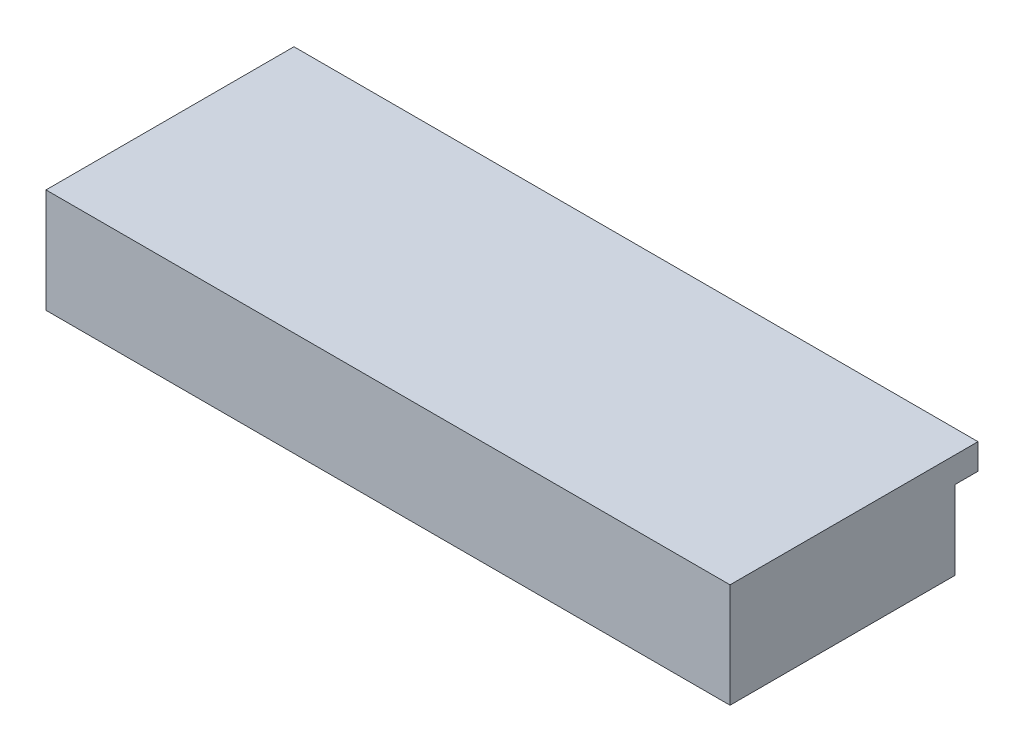
ISO-10303-21;
HEADER;
FILE_DESCRIPTION(('STEP AP214'),'2;1');
FILE_NAME('part.step','',(''),(''),'','','');
FILE_SCHEMA(('AUTOMOTIVE_DESIGN { 1 0 10303 214 1 1 1 1 }'));
ENDSEC;
DATA;
#1=APPLICATION_CONTEXT('core data for automotive mechanical design processes');
#2=APPLICATION_PROTOCOL_DEFINITION('international standard','automotive_design',2000,#1);
#3=PRODUCT_CONTEXT('',#1,'mechanical');
#4=PRODUCT('Part','Part','',(#3));
#5=PRODUCT_RELATED_PRODUCT_CATEGORY('part','',(#4));
#6=PRODUCT_DEFINITION_FORMATION('','',#4);
#7=PRODUCT_DEFINITION_CONTEXT('part definition',#1,'design');
#8=PRODUCT_DEFINITION('design','',#6,#7);
#9=PRODUCT_DEFINITION_SHAPE('','',#8);
#10=(LENGTH_UNIT() NAMED_UNIT(*) SI_UNIT(.MILLI.,.METRE.));
#11=(NAMED_UNIT(*) PLANE_ANGLE_UNIT() SI_UNIT($,.RADIAN.));
#12=(NAMED_UNIT(*) SI_UNIT($,.STERADIAN.) SOLID_ANGLE_UNIT());
#13=UNCERTAINTY_MEASURE_WITH_UNIT(LENGTH_MEASURE(1.E-05),#10,'distance_accuracy_value','');
#14=(GEOMETRIC_REPRESENTATION_CONTEXT(3) GLOBAL_UNCERTAINTY_ASSIGNED_CONTEXT((#13)) GLOBAL_UNIT_ASSIGNED_CONTEXT((#10,
#11,#12)) REPRESENTATION_CONTEXT('',''));
#15=CARTESIAN_POINT('',(0.,0.,0.));
#16=DIRECTION('',(0.,0.,1.));
#17=DIRECTION('',(1.,0.,0.));
#18=AXIS2_PLACEMENT_3D('',#15,#16,#17);
#19=CARTESIAN_POINT('',(83.,6.50000000000004,-1.5));
#20=DIRECTION('',(0.,0.,-1.));
#21=DIRECTION('',(-1.,0.,0.));
#22=AXIS2_PLACEMENT_3D('',#19,#20,#21);
#23=PLANE('',#22);
#24=DIRECTION('',(0.,1.,0.));
#25=VECTOR('',#24,1.);
#26=CARTESIAN_POINT('',(238.,-21.0000000000001,-1.5));
#27=LINE('',#26,#25);
#28=CARTESIAN_POINT('',(238.,-21.0000000000001,-1.5));
#29=VERTEX_POINT('',#28);
#30=CARTESIAN_POINT('',(238.,24.9999999999999,-1.5));
#31=VERTEX_POINT('',#30);
#32=EDGE_CURVE('E11',#29,#31,#27,.T.);
#33=ORIENTED_EDGE('',*,*,#32,.F.);
#34=DIRECTION('',(1.,0.,0.));
#35=VECTOR('',#34,1.);
#36=CARTESIAN_POINT('',(238.,-21.0000000000001,-1.5));
#37=LINE('',#36,#35);
#38=CARTESIAN_POINT('',(70.5,-21.,-1.5));
#39=VERTEX_POINT('',#38);
#40=EDGE_CURVE('E213',#39,#29,#37,.T.);
#41=ORIENTED_EDGE('',*,*,#40,.F.);
#42=DIRECTION('',(0.,-1.,0.));
#43=VECTOR('',#42,1.);
#44=CARTESIAN_POINT('',(70.5,-21.,-1.5));
#45=LINE('',#44,#43);
#46=CARTESIAN_POINT('',(70.5,-8.00000000000005,-1.5));
#47=VERTEX_POINT('',#46);
#48=EDGE_CURVE('E211',#47,#39,#45,.T.);
#49=ORIENTED_EDGE('',*,*,#48,.F.);
#50=CARTESIAN_POINT('',(72.5,-8.00000000000005,-1.5));
#51=DIRECTION('',(0.,0.,-1.));
#52=DIRECTION('',(-1.,0.,0.));
#53=AXIS2_PLACEMENT_3D('',#50,#51,#52);
#54=CIRCLE('',#53,2.);
#55=CARTESIAN_POINT('',(72.5,-6.00000000000005,-1.5));
#56=VERTEX_POINT('',#55);
#57=EDGE_CURVE('E253',#56,#47,#54,.F.);
#58=ORIENTED_EDGE('',*,*,#57,.F.);
#59=DIRECTION('',(-1.,0.,0.));
#60=VECTOR('',#59,1.);
#61=CARTESIAN_POINT('',(72.5,-6.00000000000005,-1.5));
#62=LINE('',#61,#60);
#63=CARTESIAN_POINT('',(83.,-5.99999999999994,-1.5));
#64=VERTEX_POINT('',#63);
#65=EDGE_CURVE('E256',#64,#56,#62,.T.);
#66=ORIENTED_EDGE('',*,*,#65,.F.);
#67=CARTESIAN_POINT('',(83.,6.50000000000004,-1.5));
#68=DIRECTION('',(0.,0.,-1.));
#69=DIRECTION('',(-1.,0.,0.));
#70=AXIS2_PLACEMENT_3D('',#67,#68,#69);
#71=CIRCLE('',#70,12.5);
#72=CARTESIAN_POINT('',(83.,19.,-1.5));
#73=VERTEX_POINT('',#72);
#74=EDGE_CURVE('E260',#73,#64,#71,.T.);
#75=ORIENTED_EDGE('',*,*,#74,.F.);
#76=DIRECTION('',(1.,0.,0.));
#77=VECTOR('',#76,1.);
#78=CARTESIAN_POINT('',(83.,19.,-1.5));
#79=LINE('',#78,#77);
#80=CARTESIAN_POINT('',(-70.25,19.0000000000001,-1.5));
#81=VERTEX_POINT('',#80);
#82=EDGE_CURVE('E264',#81,#73,#79,.T.);
#83=ORIENTED_EDGE('',*,*,#82,.F.);
#84=CARTESIAN_POINT('',(-70.25,6.50000000000006,-1.5));
#85=DIRECTION('',(0.,0.,-1.));
#86=DIRECTION('',(-1.,0.,0.));
#87=AXIS2_PLACEMENT_3D('',#84,#85,#86);
#88=CIRCLE('',#87,12.5);
#89=CARTESIAN_POINT('',(-70.25,-5.99999999999994,-1.5));
#90=VERTEX_POINT('',#89);
#91=EDGE_CURVE('E268',#90,#81,#88,.T.);
#92=ORIENTED_EDGE('',*,*,#91,.F.);
#93=DIRECTION('',(-1.,0.,0.));
#94=VECTOR('',#93,1.);
#95=CARTESIAN_POINT('',(-70.25,-5.99999999999994,-1.5));
#96=LINE('',#95,#94);
#97=CARTESIAN_POINT('',(-61.5,-5.99999999999995,-1.5));
#98=VERTEX_POINT('',#97);
#99=EDGE_CURVE('E272',#98,#90,#96,.T.);
#100=ORIENTED_EDGE('',*,*,#99,.F.);
#101=CARTESIAN_POINT('',(-61.5,-7.99999999999995,-1.5));
#102=DIRECTION('',(0.,0.,-1.));
#103=DIRECTION('',(-1.,0.,0.));
#104=AXIS2_PLACEMENT_3D('',#101,#102,#103);
#105=CIRCLE('',#104,2.);
#106=CARTESIAN_POINT('',(-59.5,-7.99999999999995,-1.5));
#107=VERTEX_POINT('',#106);
#108=EDGE_CURVE('E276',#107,#98,#105,.F.);
#109=ORIENTED_EDGE('',*,*,#108,.F.);
#110=DIRECTION('',(0.,1.,0.));
#111=VECTOR('',#110,1.);
#112=CARTESIAN_POINT('',(-59.5,-7.99999999999995,-1.5));
#113=LINE('',#112,#111);
#114=CARTESIAN_POINT('',(-59.5,-21.,-1.5));
#115=VERTEX_POINT('',#114);
#116=EDGE_CURVE('E228',#115,#107,#113,.T.);
#117=ORIENTED_EDGE('',*,*,#116,.F.);
#118=DIRECTION('',(1.,0.,0.));
#119=VECTOR('',#118,1.);
#120=CARTESIAN_POINT('',(-59.5,-21.,-1.5));
#121=LINE('',#120,#119);
#122=CARTESIAN_POINT('',(-162.,-20.9999999999999,-1.5));
#123=VERTEX_POINT('',#122);
#124=EDGE_CURVE('E114',#123,#115,#121,.T.);
#125=ORIENTED_EDGE('',*,*,#124,.F.);
#126=DIRECTION('',(0.,-1.,0.));
#127=VECTOR('',#126,1.);
#128=CARTESIAN_POINT('',(-162.,25.0000000000001,-1.5));
#129=LINE('',#128,#127);
#130=CARTESIAN_POINT('',(-162.,24.9999999999998,-1.5));
#131=VERTEX_POINT('',#130);
#132=EDGE_CURVE('E122',#131,#123,#129,.T.);
#133=ORIENTED_EDGE('',*,*,#132,.F.);
#134=DIRECTION('',(-1.,0.,0.));
#135=VECTOR('',#134,1.);
#136=CARTESIAN_POINT('',(238.,24.9999999999999,-1.5));
#137=LINE('',#136,#135);
#138=EDGE_CURVE('E118',#31,#131,#137,.T.);
#139=ORIENTED_EDGE('',*,*,#138,.F.);
#140=EDGE_LOOP('',(#33,#41,#49,#58,#66,#75,#83,#92,#100,#109,#117,#125,#133,#139));
#141=FACE_BOUND('',#140,.T.);
#142=ADVANCED_FACE('F31',(#141),#23,.T.);
#143=CARTESIAN_POINT('',(-162.,25.0000000000001,-404.136312321678));
#144=DIRECTION('',(-1.,0.,0.));
#145=DIRECTION('',(0.,-1.,0.));
#146=AXIS2_PLACEMENT_3D('',#143,#144,#145);
#147=PLANE('',#146);
#148=DIRECTION('',(0.,-1.,0.));
#149=VECTOR('',#148,1.);
#150=CARTESIAN_POINT('',(-162.,25.0000000000001,130.));
#151=LINE('',#150,#149);
#152=CARTESIAN_POINT('',(-162.,39.9999999999998,130.));
#153=VERTEX_POINT('',#152);
#154=CARTESIAN_POINT('',(-162.,-20.9999999999999,130.));
#155=VERTEX_POINT('',#154);
#156=EDGE_CURVE('E186',#153,#155,#151,.T.);
#157=ORIENTED_EDGE('',*,*,#156,.F.);
#158=DIRECTION('',(0.,0.,1.));
#159=VECTOR('',#158,1.);
#160=CARTESIAN_POINT('',(-162.,39.9999999999998,-15.));
#161=LINE('',#160,#159);
#162=CARTESIAN_POINT('',(-162.,39.9999999999998,-15.));
#163=VERTEX_POINT('',#162);
#164=EDGE_CURVE('E149',#163,#153,#161,.T.);
#165=ORIENTED_EDGE('',*,*,#164,.F.);
#166=DIRECTION('',(0.,-1.,0.));
#167=VECTOR('',#166,1.);
#168=CARTESIAN_POINT('',(-162.,24.9999999999998,-15.));
#169=LINE('',#168,#167);
#170=CARTESIAN_POINT('',(-162.,24.9999999999998,-15.));
#171=VERTEX_POINT('',#170);
#172=EDGE_CURVE('E168',#163,#171,#169,.T.);
#173=ORIENTED_EDGE('',*,*,#172,.T.);
#174=DIRECTION('',(0.,0.,1.));
#175=VECTOR('',#174,1.);
#176=CARTESIAN_POINT('',(-162.,24.9999999999998,-15.));
#177=LINE('',#176,#175);
#178=EDGE_CURVE('E144',#171,#131,#177,.T.);
#179=ORIENTED_EDGE('',*,*,#178,.T.);
#180=ORIENTED_EDGE('',*,*,#132,.T.);
#181=DIRECTION('',(0.,0.,1.));
#182=VECTOR('',#181,1.);
#183=CARTESIAN_POINT('',(-162.,-20.9999999999999,-404.136312321678));
#184=LINE('',#183,#182);
#185=EDGE_CURVE('E202',#123,#155,#184,.T.);
#186=ORIENTED_EDGE('',*,*,#185,.T.);
#187=EDGE_LOOP('',(#157,#165,#173,#179,#180,#186));
#188=FACE_BOUND('',#187,.T.);
#189=ADVANCED_FACE('F338',(#188),#147,.T.);
#190=CARTESIAN_POINT('',(-59.5,-21.,-404.136312321678));
#191=DIRECTION('',(0.,-1.,0.));
#192=DIRECTION('',(1.,0.,0.));
#193=AXIS2_PLACEMENT_3D('',#190,#191,#192);
#194=PLANE('',#193);
#195=ORIENTED_EDGE('',*,*,#185,.F.);
#196=ORIENTED_EDGE('',*,*,#124,.T.);
#197=DIRECTION('',(0.,0.,1.));
#198=VECTOR('',#197,1.);
#199=CARTESIAN_POINT('',(-59.5,-21.,-404.136312321678));
#200=LINE('',#199,#198);
#201=CARTESIAN_POINT('',(-59.5,-21.,0.));
#202=VERTEX_POINT('',#201);
#203=EDGE_CURVE('E224',#115,#202,#200,.T.);
#204=ORIENTED_EDGE('',*,*,#203,.T.);
#205=DIRECTION('',(1.,0.,0.));
#206=VECTOR('',#205,1.);
#207=CARTESIAN_POINT('',(-162.,-20.9999999999999,0.));
#208=LINE('',#207,#206);
#209=CARTESIAN_POINT('',(70.5,-21.,0.));
#210=VERTEX_POINT('',#209);
#211=EDGE_CURVE('E143',#202,#210,#208,.T.);
#212=ORIENTED_EDGE('',*,*,#211,.T.);
#213=DIRECTION('',(0.,0.,1.));
#214=VECTOR('',#213,1.);
#215=CARTESIAN_POINT('',(70.5,-21.,-404.136312321678));
#216=LINE('',#215,#214);
#217=EDGE_CURVE('E207',#39,#210,#216,.T.);
#218=ORIENTED_EDGE('',*,*,#217,.F.);
#219=ORIENTED_EDGE('',*,*,#40,.T.);
#220=DIRECTION('',(0.,0.,1.));
#221=VECTOR('',#220,1.);
#222=CARTESIAN_POINT('',(238.,-21.0000000000001,-404.136312321678));
#223=LINE('',#222,#221);
#224=CARTESIAN_POINT('',(238.,-21.0000000000001,130.));
#225=VERTEX_POINT('',#224);
#226=EDGE_CURVE('E40',#29,#225,#223,.T.);
#227=ORIENTED_EDGE('',*,*,#226,.T.);
#228=DIRECTION('',(1.,0.,0.));
#229=VECTOR('',#228,1.);
#230=CARTESIAN_POINT('',(-162.,-20.9999999999999,130.));
#231=LINE('',#230,#229);
#232=EDGE_CURVE('E147',#155,#225,#231,.T.);
#233=ORIENTED_EDGE('',*,*,#232,.F.);
#234=EDGE_LOOP('',(#195,#196,#204,#212,#218,#219,#227,#233));
#235=FACE_BOUND('',#234,.T.);
#236=ADVANCED_FACE('F222',(#235),#194,.T.);
#237=CARTESIAN_POINT('',(-59.5,-7.99999999999995,-404.136312321678));
#238=DIRECTION('',(1.,0.,0.));
#239=DIRECTION('',(0.,1.,0.));
#240=AXIS2_PLACEMENT_3D('',#237,#238,#239);
#241=PLANE('',#240);
#242=ORIENTED_EDGE('',*,*,#203,.F.);
#243=ORIENTED_EDGE('',*,*,#116,.T.);
#244=DIRECTION('',(0.,0.,1.));
#245=VECTOR('',#244,1.);
#246=CARTESIAN_POINT('',(-59.5,-7.99999999999995,-404.136312321678));
#247=LINE('',#246,#245);
#248=CARTESIAN_POINT('',(-59.5,-7.99999999999995,0.));
#249=VERTEX_POINT('',#248);
#250=EDGE_CURVE('E233',#107,#249,#247,.T.);
#251=ORIENTED_EDGE('',*,*,#250,.T.);
#252=DIRECTION('',(0.,1.,0.));
#253=VECTOR('',#252,1.);
#254=CARTESIAN_POINT('',(-59.5,-7.99999999999995,0.));
#255=LINE('',#254,#253);
#256=EDGE_CURVE('E230',#202,#249,#255,.T.);
#257=ORIENTED_EDGE('',*,*,#256,.F.);
#258=EDGE_LOOP('',(#242,#243,#251,#257));
#259=FACE_BOUND('',#258,.T.);
#260=ADVANCED_FACE('F231',(#259),#241,.T.);
#261=CARTESIAN_POINT('',(-61.5,-7.99999999999995,-404.136312321678));
#262=DIRECTION('',(0.,0.,1.));
#263=DIRECTION('',(1.,0.,0.));
#264=AXIS2_PLACEMENT_3D('',#261,#262,#263);
#265=CYLINDRICAL_SURFACE('',#264,2.);
#266=ORIENTED_EDGE('',*,*,#250,.F.);
#267=ORIENTED_EDGE('',*,*,#108,.T.);
#268=DIRECTION('',(0.,0.,1.));
#269=VECTOR('',#268,1.);
#270=CARTESIAN_POINT('',(-61.5,-5.99999999999995,-404.136312321678));
#271=LINE('',#270,#269);
#272=CARTESIAN_POINT('',(-61.5,-5.99999999999995,0.));
#273=VERTEX_POINT('',#272);
#274=EDGE_CURVE('E275',#98,#273,#271,.T.);
#275=ORIENTED_EDGE('',*,*,#274,.T.);
#276=CARTESIAN_POINT('',(-61.5,-7.99999999999995,0.));
#277=DIRECTION('',(0.,0.,1.));
#278=DIRECTION('',(1.,0.,0.));
#279=AXIS2_PLACEMENT_3D('',#276,#277,#278);
#280=CIRCLE('',#279,2.);
#281=EDGE_CURVE('E236',#249,#273,#280,.T.);
#282=ORIENTED_EDGE('',*,*,#281,.F.);
#283=EDGE_LOOP('',(#266,#267,#275,#282));
#284=FACE_BOUND('',#283,.T.);
#285=ADVANCED_FACE('F349',(#284),#265,.T.);
#286=CARTESIAN_POINT('',(-70.25,-5.99999999999994,-404.136312321678));
#287=DIRECTION('',(0.,1.,0.));
#288=DIRECTION('',(-1.,0.,0.));
#289=AXIS2_PLACEMENT_3D('',#286,#287,#288);
#290=PLANE('',#289);
#291=ORIENTED_EDGE('',*,*,#274,.F.);
#292=ORIENTED_EDGE('',*,*,#99,.T.);
#293=DIRECTION('',(0.,0.,1.));
#294=VECTOR('',#293,1.);
#295=CARTESIAN_POINT('',(-70.25,-5.99999999999994,-404.136312321678));
#296=LINE('',#295,#294);
#297=CARTESIAN_POINT('',(-70.25,-5.99999999999994,0.));
#298=VERTEX_POINT('',#297);
#299=EDGE_CURVE('E271',#90,#298,#296,.T.);
#300=ORIENTED_EDGE('',*,*,#299,.T.);
#301=DIRECTION('',(-1.,0.,0.));
#302=VECTOR('',#301,1.);
#303=CARTESIAN_POINT('',(-70.25,-5.99999999999994,0.));
#304=LINE('',#303,#302);
#305=EDGE_CURVE('E238',#273,#298,#304,.T.);
#306=ORIENTED_EDGE('',*,*,#305,.F.);
#307=EDGE_LOOP('',(#291,#292,#300,#306));
#308=FACE_BOUND('',#307,.T.);
#309=ADVANCED_FACE('F311',(#308),#290,.T.);
#310=CARTESIAN_POINT('',(-70.25,6.50000000000006,-404.136312321678));
#311=DIRECTION('',(0.,0.,1.));
#312=DIRECTION('',(1.,0.,0.));
#313=AXIS2_PLACEMENT_3D('',#310,#311,#312);
#314=CYLINDRICAL_SURFACE('',#313,12.5);
#315=ORIENTED_EDGE('',*,*,#299,.F.);
#316=ORIENTED_EDGE('',*,*,#91,.T.);
#317=DIRECTION('',(0.,0.,1.));
#318=VECTOR('',#317,1.);
#319=CARTESIAN_POINT('',(-70.25,19.0000000000001,-404.136312321678));
#320=LINE('',#319,#318);
#321=CARTESIAN_POINT('',(-70.25,19.0000000000001,0.));
#322=VERTEX_POINT('',#321);
#323=EDGE_CURVE('E267',#81,#322,#320,.T.);
#324=ORIENTED_EDGE('',*,*,#323,.T.);
#325=CARTESIAN_POINT('',(-70.25,6.50000000000006,0.));
#326=DIRECTION('',(0.,0.,-1.));
#327=DIRECTION('',(1.,0.,0.));
#328=AXIS2_PLACEMENT_3D('',#325,#326,#327);
#329=CIRCLE('',#328,12.5);
#330=EDGE_CURVE('E304',#298,#322,#329,.T.);
#331=ORIENTED_EDGE('',*,*,#330,.F.);
#332=EDGE_LOOP('',(#315,#316,#324,#331));
#333=FACE_BOUND('',#332,.T.);
#334=ADVANCED_FACE('F314',(#333),#314,.F.);
#335=CARTESIAN_POINT('',(83.,19.,-404.136312321678));
#336=DIRECTION('',(0.,-1.,0.));
#337=DIRECTION('',(1.,0.,0.));
#338=AXIS2_PLACEMENT_3D('',#335,#336,#337);
#339=PLANE('',#338);
#340=ORIENTED_EDGE('',*,*,#323,.F.);
#341=ORIENTED_EDGE('',*,*,#82,.T.);
#342=DIRECTION('',(0.,0.,1.));
#343=VECTOR('',#342,1.);
#344=CARTESIAN_POINT('',(83.,19.,-404.136312321678));
#345=LINE('',#344,#343);
#346=CARTESIAN_POINT('',(83.,19.,0.));
#347=VERTEX_POINT('',#346);
#348=EDGE_CURVE('E263',#73,#347,#345,.T.);
#349=ORIENTED_EDGE('',*,*,#348,.T.);
#350=DIRECTION('',(1.,0.,0.));
#351=VECTOR('',#350,1.);
#352=CARTESIAN_POINT('',(83.,19.,0.));
#353=LINE('',#352,#351);
#354=EDGE_CURVE('E301',#322,#347,#353,.T.);
#355=ORIENTED_EDGE('',*,*,#354,.F.);
#356=EDGE_LOOP('',(#340,#341,#349,#355));
#357=FACE_BOUND('',#356,.T.);
#358=ADVANCED_FACE('F318',(#357),#339,.T.);
#359=CARTESIAN_POINT('',(83.,6.50000000000004,-404.136312321678));
#360=DIRECTION('',(0.,0.,1.));
#361=DIRECTION('',(1.,0.,0.));
#362=AXIS2_PLACEMENT_3D('',#359,#360,#361);
#363=CYLINDRICAL_SURFACE('',#362,12.5);
#364=ORIENTED_EDGE('',*,*,#348,.F.);
#365=ORIENTED_EDGE('',*,*,#74,.T.);
#366=DIRECTION('',(0.,0.,1.));
#367=VECTOR('',#366,1.);
#368=CARTESIAN_POINT('',(83.,-5.99999999999994,-404.136312321678));
#369=LINE('',#368,#367);
#370=CARTESIAN_POINT('',(83.,-5.99999999999994,0.));
#371=VERTEX_POINT('',#370);
#372=EDGE_CURVE('E259',#64,#371,#369,.T.);
#373=ORIENTED_EDGE('',*,*,#372,.T.);
#374=CARTESIAN_POINT('',(83.,6.50000000000004,0.));
#375=DIRECTION('',(0.,0.,-1.));
#376=DIRECTION('',(1.,0.,0.));
#377=AXIS2_PLACEMENT_3D('',#374,#375,#376);
#378=CIRCLE('',#377,12.5);
#379=EDGE_CURVE('E298',#347,#371,#378,.T.);
#380=ORIENTED_EDGE('',*,*,#379,.F.);
#381=EDGE_LOOP('',(#364,#365,#373,#380));
#382=FACE_BOUND('',#381,.T.);
#383=ADVANCED_FACE('F323',(#382),#363,.F.);
#384=CARTESIAN_POINT('',(72.5,-6.00000000000005,-404.136312321678));
#385=DIRECTION('',(0.,1.,0.));
#386=DIRECTION('',(-1.,0.,0.));
#387=AXIS2_PLACEMENT_3D('',#384,#385,#386);
#388=PLANE('',#387);
#389=ORIENTED_EDGE('',*,*,#372,.F.);
#390=ORIENTED_EDGE('',*,*,#65,.T.);
#391=DIRECTION('',(0.,0.,1.));
#392=VECTOR('',#391,1.);
#393=CARTESIAN_POINT('',(72.5,-6.00000000000005,-404.136312321678));
#394=LINE('',#393,#392);
#395=CARTESIAN_POINT('',(72.5,-6.00000000000005,0.));
#396=VERTEX_POINT('',#395);
#397=EDGE_CURVE('E255',#56,#396,#394,.T.);
#398=ORIENTED_EDGE('',*,*,#397,.T.);
#399=DIRECTION('',(-1.,0.,0.));
#400=VECTOR('',#399,1.);
#401=CARTESIAN_POINT('',(72.5,-6.00000000000005,0.));
#402=LINE('',#401,#400);
#403=EDGE_CURVE('E296',#371,#396,#402,.T.);
#404=ORIENTED_EDGE('',*,*,#403,.F.);
#405=EDGE_LOOP('',(#389,#390,#398,#404));
#406=FACE_BOUND('',#405,.T.);
#407=ADVANCED_FACE('F326',(#406),#388,.T.);
#408=CARTESIAN_POINT('',(72.5,-8.00000000000005,-404.136312321678));
#409=DIRECTION('',(0.,0.,1.));
#410=DIRECTION('',(1.,0.,0.));
#411=AXIS2_PLACEMENT_3D('',#408,#409,#410);
#412=CYLINDRICAL_SURFACE('',#411,2.);
#413=ORIENTED_EDGE('',*,*,#397,.F.);
#414=ORIENTED_EDGE('',*,*,#57,.T.);
#415=DIRECTION('',(0.,0.,1.));
#416=VECTOR('',#415,1.);
#417=CARTESIAN_POINT('',(70.5,-8.00000000000005,-404.136312321678));
#418=LINE('',#417,#416);
#419=CARTESIAN_POINT('',(70.5,-8.00000000000005,0.));
#420=VERTEX_POINT('',#419);
#421=EDGE_CURVE('E48',#47,#420,#418,.T.);
#422=ORIENTED_EDGE('',*,*,#421,.T.);
#423=CARTESIAN_POINT('',(72.5,-8.00000000000005,0.));
#424=DIRECTION('',(0.,0.,1.));
#425=DIRECTION('',(1.,0.,0.));
#426=AXIS2_PLACEMENT_3D('',#423,#424,#425);
#427=CIRCLE('',#426,2.);
#428=EDGE_CURVE('E220',#396,#420,#427,.T.);
#429=ORIENTED_EDGE('',*,*,#428,.F.);
#430=EDGE_LOOP('',(#413,#414,#422,#429));
#431=FACE_BOUND('',#430,.T.);
#432=ADVANCED_FACE('F328',(#431),#412,.T.);
#433=CARTESIAN_POINT('',(70.5,-21.,-404.136312321678));
#434=DIRECTION('',(-1.,0.,0.));
#435=DIRECTION('',(0.,0.,1.));
#436=AXIS2_PLACEMENT_3D('',#433,#434,#435);
#437=PLANE('',#436);
#438=ORIENTED_EDGE('',*,*,#421,.F.);
#439=ORIENTED_EDGE('',*,*,#48,.T.);
#440=ORIENTED_EDGE('',*,*,#217,.T.);
#441=DIRECTION('',(0.,-1.,0.));
#442=VECTOR('',#441,1.);
#443=CARTESIAN_POINT('',(70.5,-21.,0.));
#444=LINE('',#443,#442);
#445=EDGE_CURVE('E127',#420,#210,#444,.T.);
#446=ORIENTED_EDGE('',*,*,#445,.F.);
#447=EDGE_LOOP('',(#438,#439,#440,#446));
#448=FACE_BOUND('',#447,.T.);
#449=ADVANCED_FACE('F209',(#448),#437,.T.);
#450=CARTESIAN_POINT('',(238.,-21.0000000000001,-404.136312321678));
#451=DIRECTION('',(1.,0.,0.));
#452=DIRECTION('',(0.,0.,-1.));
#453=AXIS2_PLACEMENT_3D('',#450,#451,#452);
#454=PLANE('',#453);
#455=ORIENTED_EDGE('',*,*,#226,.F.);
#456=ORIENTED_EDGE('',*,*,#32,.T.);
#457=DIRECTION('',(0.,0.,1.));
#458=VECTOR('',#457,1.);
#459=CARTESIAN_POINT('',(238.,24.9999999999999,-15.));
#460=LINE('',#459,#458);
#461=CARTESIAN_POINT('',(238.,24.9999999999999,-15.));
#462=VERTEX_POINT('',#461);
#463=EDGE_CURVE('E134',#462,#31,#460,.T.);
#464=ORIENTED_EDGE('',*,*,#463,.F.);
#465=DIRECTION('',(0.,1.,0.));
#466=VECTOR('',#465,1.);
#467=CARTESIAN_POINT('',(238.,24.9999999999999,-15.));
#468=LINE('',#467,#466);
#469=CARTESIAN_POINT('',(238.,39.9999999999999,-15.));
#470=VERTEX_POINT('',#469);
#471=EDGE_CURVE('E175',#462,#470,#468,.T.);
#472=ORIENTED_EDGE('',*,*,#471,.T.);
#473=DIRECTION('',(0.,0.,1.));
#474=VECTOR('',#473,1.);
#475=CARTESIAN_POINT('',(238.,39.9999999999999,-15.));
#476=LINE('',#475,#474);
#477=CARTESIAN_POINT('',(238.,39.9999999999999,130.));
#478=VERTEX_POINT('',#477);
#479=EDGE_CURVE('E163',#470,#478,#476,.T.);
#480=ORIENTED_EDGE('',*,*,#479,.T.);
#481=DIRECTION('',(0.,1.,0.));
#482=VECTOR('',#481,1.);
#483=CARTESIAN_POINT('',(238.,-21.0000000000001,130.));
#484=LINE('',#483,#482);
#485=EDGE_CURVE('E188',#225,#478,#484,.T.);
#486=ORIENTED_EDGE('',*,*,#485,.F.);
#487=EDGE_LOOP('',(#455,#456,#464,#472,#480,#486));
#488=FACE_BOUND('',#487,.T.);
#489=ADVANCED_FACE('F131',(#488),#454,.T.);
#490=CARTESIAN_POINT('',(238.,-21.0000000000001,0.));
#491=DIRECTION('',(0.,0.,1.));
#492=DIRECTION('',(1.,0.,0.));
#493=AXIS2_PLACEMENT_3D('',#490,#491,#492);
#494=PLANE('',#493);
#495=ORIENTED_EDGE('',*,*,#211,.F.);
#496=ORIENTED_EDGE('',*,*,#256,.T.);
#497=ORIENTED_EDGE('',*,*,#281,.T.);
#498=ORIENTED_EDGE('',*,*,#305,.T.);
#499=ORIENTED_EDGE('',*,*,#330,.T.);
#500=ORIENTED_EDGE('',*,*,#354,.T.);
#501=ORIENTED_EDGE('',*,*,#379,.T.);
#502=ORIENTED_EDGE('',*,*,#403,.T.);
#503=ORIENTED_EDGE('',*,*,#428,.T.);
#504=ORIENTED_EDGE('',*,*,#445,.T.);
#505=EDGE_LOOP('',(#495,#496,#497,#498,#499,#500,#501,#502,#503,#504));
#506=FACE_BOUND('',#505,.T.);
#507=ADVANCED_FACE('F217',(#506),#494,.F.);
#508=CARTESIAN_POINT('',(238.,-21.0000000000001,130.));
#509=DIRECTION('',(0.,0.,1.));
#510=DIRECTION('',(1.,0.,0.));
#511=AXIS2_PLACEMENT_3D('',#508,#509,#510);
#512=PLANE('',#511);
#513=ORIENTED_EDGE('',*,*,#232,.T.);
#514=ORIENTED_EDGE('',*,*,#485,.T.);
#515=DIRECTION('',(-1.,0.,0.));
#516=VECTOR('',#515,1.);
#517=CARTESIAN_POINT('',(238.,39.9999999999999,130.));
#518=LINE('',#517,#516);
#519=EDGE_CURVE('E158',#478,#153,#518,.T.);
#520=ORIENTED_EDGE('',*,*,#519,.T.);
#521=ORIENTED_EDGE('',*,*,#156,.T.);
#522=EDGE_LOOP('',(#513,#514,#520,#521));
#523=FACE_BOUND('',#522,.T.);
#524=ADVANCED_FACE('F183',(#523),#512,.T.);
#525=CARTESIAN_POINT('',(238.,24.9999999999999,-15.));
#526=DIRECTION('',(0.,-1.,0.));
#527=DIRECTION('',(1.,0.,0.));
#528=AXIS2_PLACEMENT_3D('',#525,#526,#527);
#529=PLANE('',#528);
#530=ORIENTED_EDGE('',*,*,#463,.T.);
#531=ORIENTED_EDGE('',*,*,#138,.T.);
#532=ORIENTED_EDGE('',*,*,#178,.F.);
#533=DIRECTION('',(1.,0.,0.));
#534=VECTOR('',#533,1.);
#535=CARTESIAN_POINT('',(238.,24.9999999999999,-15.));
#536=LINE('',#535,#534);
#537=EDGE_CURVE('E142',#171,#462,#536,.T.);
#538=ORIENTED_EDGE('',*,*,#537,.T.);
#539=EDGE_LOOP('',(#530,#531,#532,#538));
#540=FACE_BOUND('',#539,.T.);
#541=ADVANCED_FACE('F140',(#540),#529,.T.);
#542=CARTESIAN_POINT('',(238.,39.9999999999999,-15.));
#543=DIRECTION('',(0.,1.,0.));
#544=DIRECTION('',(-1.,0.,0.));
#545=AXIS2_PLACEMENT_3D('',#542,#543,#544);
#546=PLANE('',#545);
#547=ORIENTED_EDGE('',*,*,#519,.F.);
#548=ORIENTED_EDGE('',*,*,#479,.F.);
#549=DIRECTION('',(-1.,0.,0.));
#550=VECTOR('',#549,1.);
#551=CARTESIAN_POINT('',(238.,39.9999999999999,-15.));
#552=LINE('',#551,#550);
#553=EDGE_CURVE('E170',#470,#163,#552,.T.);
#554=ORIENTED_EDGE('',*,*,#553,.T.);
#555=ORIENTED_EDGE('',*,*,#164,.T.);
#556=EDGE_LOOP('',(#547,#548,#554,#555));
#557=FACE_BOUND('',#556,.T.);
#558=ADVANCED_FACE('F191',(#557),#546,.T.);
#559=CARTESIAN_POINT('',(238.,39.9999999999999,-15.));
#560=DIRECTION('',(0.,0.,1.));
#561=DIRECTION('',(1.,0.,0.));
#562=AXIS2_PLACEMENT_3D('',#559,#560,#561);
#563=PLANE('',#562);
#564=ORIENTED_EDGE('',*,*,#471,.F.);
#565=ORIENTED_EDGE('',*,*,#537,.F.);
#566=ORIENTED_EDGE('',*,*,#172,.F.);
#567=ORIENTED_EDGE('',*,*,#553,.F.);
#568=EDGE_LOOP('',(#564,#565,#566,#567));
#569=FACE_BOUND('',#568,.T.);
#570=ADVANCED_FACE('F432',(#569),#563,.F.);
#571=CLOSED_SHELL('',(#142,#189,#236,#260,#285,#309,#334,#358,#383,#407,#432,#449,#489,#507,
#524,#541,#558,#570));
#572=MANIFOLD_SOLID_BREP('B2',#571);
#573=ADVANCED_BREP_SHAPE_REPRESENTATION('',(#18,#572),#14);
#574=SHAPE_DEFINITION_REPRESENTATION(#9,#573);
ENDSEC;
END-ISO-10303-21;
